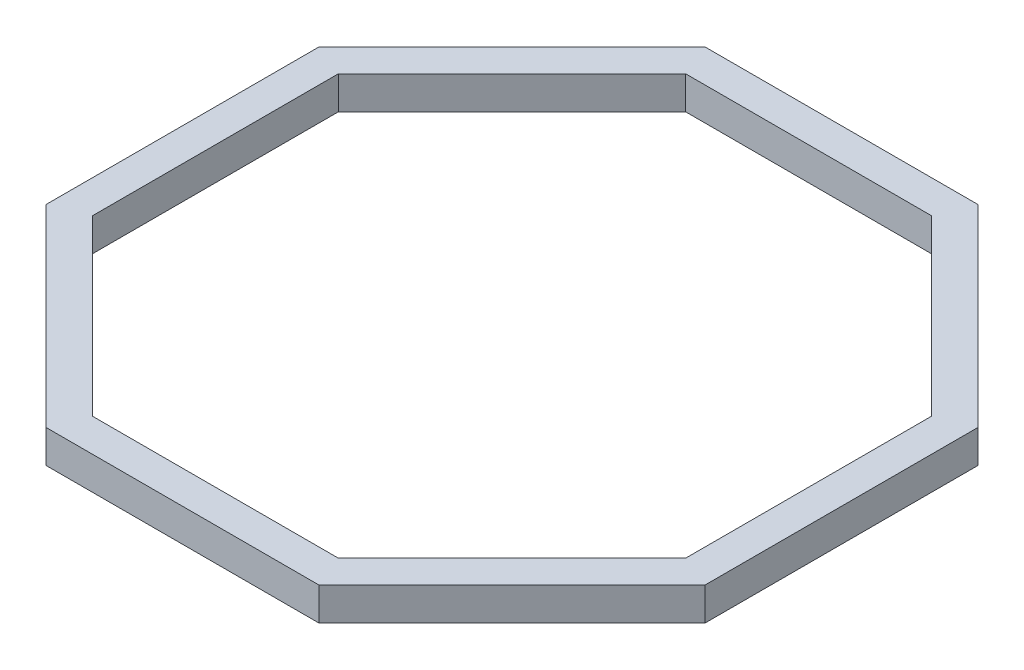
ISO-10303-21;
HEADER;
FILE_DESCRIPTION(('STEP AP214'),'2;1');
FILE_NAME('part.step','',(''),(''),'','','');
FILE_SCHEMA(('AUTOMOTIVE_DESIGN { 1 0 10303 214 1 1 1 1 }'));
ENDSEC;
DATA;
#1=APPLICATION_CONTEXT('core data for automotive mechanical design processes');
#2=APPLICATION_PROTOCOL_DEFINITION('international standard','automotive_design',2000,#1);
#3=PRODUCT_CONTEXT('',#1,'mechanical');
#4=PRODUCT('Part','Part','',(#3));
#5=PRODUCT_RELATED_PRODUCT_CATEGORY('part','',(#4));
#6=PRODUCT_DEFINITION_FORMATION('','',#4);
#7=PRODUCT_DEFINITION_CONTEXT('part definition',#1,'design');
#8=PRODUCT_DEFINITION('design','',#6,#7);
#9=PRODUCT_DEFINITION_SHAPE('','',#8);
#10=(LENGTH_UNIT() NAMED_UNIT(*) SI_UNIT(.MILLI.,.METRE.));
#11=(NAMED_UNIT(*) PLANE_ANGLE_UNIT() SI_UNIT($,.RADIAN.));
#12=(NAMED_UNIT(*) SI_UNIT($,.STERADIAN.) SOLID_ANGLE_UNIT());
#13=UNCERTAINTY_MEASURE_WITH_UNIT(LENGTH_MEASURE(1.E-05),#10,'distance_accuracy_value','');
#14=(GEOMETRIC_REPRESENTATION_CONTEXT(3) GLOBAL_UNCERTAINTY_ASSIGNED_CONTEXT((#13)) GLOBAL_UNIT_ASSIGNED_CONTEXT((#10,
#11,#12)) REPRESENTATION_CONTEXT('',''));
#15=CARTESIAN_POINT('',(0.,0.,0.));
#16=DIRECTION('',(0.,0.,1.));
#17=DIRECTION('',(1.,0.,0.));
#18=AXIS2_PLACEMENT_3D('',#15,#16,#17);
#19=CARTESIAN_POINT('',(0.,30.,0.));
#20=DIRECTION('',(0.,1.,0.));
#21=DIRECTION('',(0.,0.,1.));
#22=AXIS2_PLACEMENT_3D('',#19,#20,#21);
#23=PLANE('',#22);
#24=DIRECTION('',(0.707106781186547,0.,-0.707106781186548));
#25=VECTOR('',#24,1.);
#26=CARTESIAN_POINT('',(124.264068711929,30.,300.));
#27=LINE('',#26,#25);
#28=CARTESIAN_POINT('',(124.264068711929,30.,300.));
#29=VERTEX_POINT('',#28);
#30=CARTESIAN_POINT('',(300.,30.,124.264068711928));
#31=VERTEX_POINT('',#30);
#32=EDGE_CURVE('E242',#29,#31,#27,.T.);
#33=ORIENTED_EDGE('',*,*,#32,.T.);
#34=DIRECTION('',(0.,0.,-1.));
#35=VECTOR('',#34,1.);
#36=CARTESIAN_POINT('',(300.,30.,124.264068711928));
#37=LINE('',#36,#35);
#38=CARTESIAN_POINT('',(300.,30.,-124.264068711929));
#39=VERTEX_POINT('',#38);
#40=EDGE_CURVE('E246',#31,#39,#37,.T.);
#41=ORIENTED_EDGE('',*,*,#40,.T.);
#42=DIRECTION('',(-0.707106781186548,0.,-0.707106781186547));
#43=VECTOR('',#42,1.);
#44=CARTESIAN_POINT('',(300.,30.,-124.264068711929));
#45=LINE('',#44,#43);
#46=CARTESIAN_POINT('',(124.264068711928,30.,-300.));
#47=VERTEX_POINT('',#46);
#48=EDGE_CURVE('E250',#39,#47,#45,.T.);
#49=ORIENTED_EDGE('',*,*,#48,.T.);
#50=DIRECTION('',(-1.,0.,0.));
#51=VECTOR('',#50,1.);
#52=CARTESIAN_POINT('',(124.264068711928,30.,-300.));
#53=LINE('',#52,#51);
#54=CARTESIAN_POINT('',(-124.264068711928,30.,-300.));
#55=VERTEX_POINT('',#54);
#56=EDGE_CURVE('E253',#47,#55,#53,.T.);
#57=ORIENTED_EDGE('',*,*,#56,.T.);
#58=DIRECTION('',(-0.707106781186547,0.,0.707106781186548));
#59=VECTOR('',#58,1.);
#60=CARTESIAN_POINT('',(-124.264068711928,30.,-300.));
#61=LINE('',#60,#59);
#62=CARTESIAN_POINT('',(-300.,30.,-124.264068711928));
#63=VERTEX_POINT('',#62);
#64=EDGE_CURVE('E256',#55,#63,#61,.T.);
#65=ORIENTED_EDGE('',*,*,#64,.T.);
#66=DIRECTION('',(0.,0.,1.));
#67=VECTOR('',#66,1.);
#68=CARTESIAN_POINT('',(-300.,30.,-124.264068711928));
#69=LINE('',#68,#67);
#70=CARTESIAN_POINT('',(-300.,30.,124.264068711929));
#71=VERTEX_POINT('',#70);
#72=EDGE_CURVE('E259',#63,#71,#69,.T.);
#73=ORIENTED_EDGE('',*,*,#72,.T.);
#74=DIRECTION('',(0.707106781186548,0.,0.707106781186547));
#75=VECTOR('',#74,1.);
#76=CARTESIAN_POINT('',(-300.,30.,124.264068711929));
#77=LINE('',#76,#75);
#78=CARTESIAN_POINT('',(-124.264068711928,30.,300.));
#79=VERTEX_POINT('',#78);
#80=EDGE_CURVE('E262',#71,#79,#77,.T.);
#81=ORIENTED_EDGE('',*,*,#80,.T.);
#82=DIRECTION('',(1.,0.,0.));
#83=VECTOR('',#82,1.);
#84=CARTESIAN_POINT('',(-124.264068711928,30.,300.));
#85=LINE('',#84,#83);
#86=EDGE_CURVE('E265',#79,#29,#85,.T.);
#87=ORIENTED_EDGE('',*,*,#86,.T.);
#88=EDGE_LOOP('',(#33,#41,#49,#57,#65,#73,#81,#87));
#89=FACE_BOUND('',#88,.T.);
#90=DIRECTION('',(0.,0.,-1.));
#91=VECTOR('',#90,1.);
#92=CARTESIAN_POINT('',(270.,30.,111.837661840736));
#93=LINE('',#92,#91);
#94=CARTESIAN_POINT('',(270.,30.,111.837661840736));
#95=VERTEX_POINT('',#94);
#96=CARTESIAN_POINT('',(270.,30.,-111.837661840736));
#97=VERTEX_POINT('',#96);
#98=EDGE_CURVE('E162',#95,#97,#93,.T.);
#99=ORIENTED_EDGE('',*,*,#98,.F.);
#100=DIRECTION('',(0.707106781186547,0.,-0.707106781186548));
#101=VECTOR('',#100,1.);
#102=CARTESIAN_POINT('',(111.837661840736,30.,270.));
#103=LINE('',#102,#101);
#104=CARTESIAN_POINT('',(111.837661840736,30.,270.));
#105=VERTEX_POINT('',#104);
#106=EDGE_CURVE('E153',#105,#95,#103,.T.);
#107=ORIENTED_EDGE('',*,*,#106,.F.);
#108=DIRECTION('',(1.,0.,0.));
#109=VECTOR('',#108,1.);
#110=CARTESIAN_POINT('',(-111.837661840736,30.,270.));
#111=LINE('',#110,#109);
#112=CARTESIAN_POINT('',(-111.837661840736,30.,270.));
#113=VERTEX_POINT('',#112);
#114=EDGE_CURVE('E194',#113,#105,#111,.T.);
#115=ORIENTED_EDGE('',*,*,#114,.F.);
#116=DIRECTION('',(0.707106781186548,0.,0.707106781186547));
#117=VECTOR('',#116,1.);
#118=CARTESIAN_POINT('',(-270.,30.,111.837661840736));
#119=LINE('',#118,#117);
#120=CARTESIAN_POINT('',(-270.,30.,111.837661840736));
#121=VERTEX_POINT('',#120);
#122=EDGE_CURVE('E191',#121,#113,#119,.T.);
#123=ORIENTED_EDGE('',*,*,#122,.F.);
#124=DIRECTION('',(0.,0.,1.));
#125=VECTOR('',#124,1.);
#126=CARTESIAN_POINT('',(-270.,30.,-111.837661840736));
#127=LINE('',#126,#125);
#128=CARTESIAN_POINT('',(-270.,30.,-111.837661840736));
#129=VERTEX_POINT('',#128);
#130=EDGE_CURVE('E188',#129,#121,#127,.T.);
#131=ORIENTED_EDGE('',*,*,#130,.F.);
#132=DIRECTION('',(-0.707106781186547,0.,0.707106781186548));
#133=VECTOR('',#132,1.);
#134=CARTESIAN_POINT('',(-111.837661840736,30.,-270.));
#135=LINE('',#134,#133);
#136=CARTESIAN_POINT('',(-111.837661840736,30.,-270.));
#137=VERTEX_POINT('',#136);
#138=EDGE_CURVE('E185',#137,#129,#135,.T.);
#139=ORIENTED_EDGE('',*,*,#138,.F.);
#140=DIRECTION('',(-1.,0.,0.));
#141=VECTOR('',#140,1.);
#142=CARTESIAN_POINT('',(111.837661840736,30.,-270.));
#143=LINE('',#142,#141);
#144=CARTESIAN_POINT('',(111.837661840736,30.,-270.));
#145=VERTEX_POINT('',#144);
#146=EDGE_CURVE('E180',#145,#137,#143,.T.);
#147=ORIENTED_EDGE('',*,*,#146,.F.);
#148=DIRECTION('',(-0.707106781186548,0.,-0.707106781186547));
#149=VECTOR('',#148,1.);
#150=CARTESIAN_POINT('',(270.,30.,-111.837661840736));
#151=LINE('',#150,#149);
#152=EDGE_CURVE('E176',#97,#145,#151,.T.);
#153=ORIENTED_EDGE('',*,*,#152,.F.);
#154=EDGE_LOOP('',(#99,#107,#115,#123,#131,#139,#147,#153));
#155=FACE_BOUND('',#154,.T.);
#156=ADVANCED_FACE('F39',(#89,#155),#23,.T.);
#157=CARTESIAN_POINT('',(0.,0.,0.));
#158=DIRECTION('',(0.,1.,0.));
#159=DIRECTION('',(0.,0.,1.));
#160=AXIS2_PLACEMENT_3D('',#157,#158,#159);
#161=PLANE('',#160);
#162=DIRECTION('',(0.707106781186547,0.,-0.707106781186548));
#163=VECTOR('',#162,1.);
#164=CARTESIAN_POINT('',(124.264068711929,0.,300.));
#165=LINE('',#164,#163);
#166=CARTESIAN_POINT('',(124.264068711929,0.,300.));
#167=VERTEX_POINT('',#166);
#168=CARTESIAN_POINT('',(300.,0.,124.264068711928));
#169=VERTEX_POINT('',#168);
#170=EDGE_CURVE('E171',#167,#169,#165,.T.);
#171=ORIENTED_EDGE('',*,*,#170,.F.);
#172=DIRECTION('',(1.,0.,0.));
#173=VECTOR('',#172,1.);
#174=CARTESIAN_POINT('',(-124.264068711928,0.,300.));
#175=LINE('',#174,#173);
#176=CARTESIAN_POINT('',(-124.264068711928,0.,300.));
#177=VERTEX_POINT('',#176);
#178=EDGE_CURVE('E247',#177,#167,#175,.T.);
#179=ORIENTED_EDGE('',*,*,#178,.F.);
#180=DIRECTION('',(0.707106781186548,0.,0.707106781186547));
#181=VECTOR('',#180,1.);
#182=CARTESIAN_POINT('',(-300.,0.,124.264068711929));
#183=LINE('',#182,#181);
#184=CARTESIAN_POINT('',(-300.,0.,124.264068711929));
#185=VERTEX_POINT('',#184);
#186=EDGE_CURVE('E287',#185,#177,#183,.T.);
#187=ORIENTED_EDGE('',*,*,#186,.F.);
#188=DIRECTION('',(0.,0.,1.));
#189=VECTOR('',#188,1.);
#190=CARTESIAN_POINT('',(-300.,0.,-124.264068711928));
#191=LINE('',#190,#189);
#192=CARTESIAN_POINT('',(-300.,0.,-124.264068711928));
#193=VERTEX_POINT('',#192);
#194=EDGE_CURVE('E284',#193,#185,#191,.T.);
#195=ORIENTED_EDGE('',*,*,#194,.F.);
#196=DIRECTION('',(-0.707106781186547,0.,0.707106781186548));
#197=VECTOR('',#196,1.);
#198=CARTESIAN_POINT('',(-124.264068711928,0.,-300.));
#199=LINE('',#198,#197);
#200=CARTESIAN_POINT('',(-124.264068711928,0.,-300.));
#201=VERTEX_POINT('',#200);
#202=EDGE_CURVE('E281',#201,#193,#199,.T.);
#203=ORIENTED_EDGE('',*,*,#202,.F.);
#204=DIRECTION('',(-1.,0.,0.));
#205=VECTOR('',#204,1.);
#206=CARTESIAN_POINT('',(124.264068711928,0.,-300.));
#207=LINE('',#206,#205);
#208=CARTESIAN_POINT('',(124.264068711928,0.,-300.));
#209=VERTEX_POINT('',#208);
#210=EDGE_CURVE('E278',#209,#201,#207,.T.);
#211=ORIENTED_EDGE('',*,*,#210,.F.);
#212=DIRECTION('',(-0.707106781186548,0.,-0.707106781186547));
#213=VECTOR('',#212,1.);
#214=CARTESIAN_POINT('',(300.,0.,-124.264068711929));
#215=LINE('',#214,#213);
#216=CARTESIAN_POINT('',(300.,0.,-124.264068711929));
#217=VERTEX_POINT('',#216);
#218=EDGE_CURVE('E275',#217,#209,#215,.T.);
#219=ORIENTED_EDGE('',*,*,#218,.F.);
#220=DIRECTION('',(0.,0.,-1.));
#221=VECTOR('',#220,1.);
#222=CARTESIAN_POINT('',(300.,0.,124.264068711928));
#223=LINE('',#222,#221);
#224=EDGE_CURVE('E272',#169,#217,#223,.T.);
#225=ORIENTED_EDGE('',*,*,#224,.F.);
#226=EDGE_LOOP('',(#171,#179,#187,#195,#203,#211,#219,#225));
#227=FACE_BOUND('',#226,.T.);
#228=DIRECTION('',(0.707106781186547,0.,-0.707106781186548));
#229=VECTOR('',#228,1.);
#230=CARTESIAN_POINT('',(111.837661840736,0.,270.));
#231=LINE('',#230,#229);
#232=CARTESIAN_POINT('',(111.837661840736,0.,270.));
#233=VERTEX_POINT('',#232);
#234=CARTESIAN_POINT('',(270.,0.,111.837661840736));
#235=VERTEX_POINT('',#234);
#236=EDGE_CURVE('E63',#233,#235,#231,.T.);
#237=ORIENTED_EDGE('',*,*,#236,.T.);
#238=DIRECTION('',(0.,0.,-1.));
#239=VECTOR('',#238,1.);
#240=CARTESIAN_POINT('',(270.,0.,111.837661840736));
#241=LINE('',#240,#239);
#242=CARTESIAN_POINT('',(270.,0.,-111.837661840736));
#243=VERTEX_POINT('',#242);
#244=EDGE_CURVE('E169',#235,#243,#241,.T.);
#245=ORIENTED_EDGE('',*,*,#244,.T.);
#246=DIRECTION('',(-0.707106781186548,0.,-0.707106781186547));
#247=VECTOR('',#246,1.);
#248=CARTESIAN_POINT('',(270.,0.,-111.837661840736));
#249=LINE('',#248,#247);
#250=CARTESIAN_POINT('',(111.837661840736,0.,-270.));
#251=VERTEX_POINT('',#250);
#252=EDGE_CURVE('E201',#243,#251,#249,.T.);
#253=ORIENTED_EDGE('',*,*,#252,.T.);
#254=DIRECTION('',(-1.,0.,0.));
#255=VECTOR('',#254,1.);
#256=CARTESIAN_POINT('',(111.837661840736,0.,-270.));
#257=LINE('',#256,#255);
#258=CARTESIAN_POINT('',(-111.837661840736,0.,-270.));
#259=VERTEX_POINT('',#258);
#260=EDGE_CURVE('E205',#251,#259,#257,.T.);
#261=ORIENTED_EDGE('',*,*,#260,.T.);
#262=DIRECTION('',(-0.707106781186547,0.,0.707106781186548));
#263=VECTOR('',#262,1.);
#264=CARTESIAN_POINT('',(-111.837661840736,0.,-270.));
#265=LINE('',#264,#263);
#266=CARTESIAN_POINT('',(-270.,0.,-111.837661840736));
#267=VERTEX_POINT('',#266);
#268=EDGE_CURVE('E209',#259,#267,#265,.T.);
#269=ORIENTED_EDGE('',*,*,#268,.T.);
#270=DIRECTION('',(0.,0.,1.));
#271=VECTOR('',#270,1.);
#272=CARTESIAN_POINT('',(-270.,0.,-111.837661840736));
#273=LINE('',#272,#271);
#274=CARTESIAN_POINT('',(-270.,0.,111.837661840736));
#275=VERTEX_POINT('',#274);
#276=EDGE_CURVE('E213',#267,#275,#273,.T.);
#277=ORIENTED_EDGE('',*,*,#276,.T.);
#278=DIRECTION('',(0.707106781186548,0.,0.707106781186547));
#279=VECTOR('',#278,1.);
#280=CARTESIAN_POINT('',(-270.,0.,111.837661840736));
#281=LINE('',#280,#279);
#282=CARTESIAN_POINT('',(-111.837661840736,0.,270.));
#283=VERTEX_POINT('',#282);
#284=EDGE_CURVE('E217',#275,#283,#281,.T.);
#285=ORIENTED_EDGE('',*,*,#284,.T.);
#286=DIRECTION('',(1.,0.,0.));
#287=VECTOR('',#286,1.);
#288=CARTESIAN_POINT('',(-111.837661840736,0.,270.));
#289=LINE('',#288,#287);
#290=EDGE_CURVE('E163',#283,#233,#289,.T.);
#291=ORIENTED_EDGE('',*,*,#290,.T.);
#292=EDGE_LOOP('',(#237,#245,#253,#261,#269,#277,#285,#291));
#293=FACE_BOUND('',#292,.T.);
#294=ADVANCED_FACE('F326',(#227,#293),#161,.F.);
#295=CARTESIAN_POINT('',(124.264068711929,30.,300.));
#296=DIRECTION('',(-0.707106781186548,0.,-0.707106781186547));
#297=DIRECTION('',(-0.707106781186547,0.,0.707106781186548));
#298=AXIS2_PLACEMENT_3D('',#295,#296,#297);
#299=PLANE('',#298);
#300=ORIENTED_EDGE('',*,*,#170,.T.);
#301=DIRECTION('',(0.,-1.,0.));
#302=VECTOR('',#301,1.);
#303=CARTESIAN_POINT('',(300.,30.,124.264068711928));
#304=LINE('',#303,#302);
#305=EDGE_CURVE('E11',#31,#169,#304,.T.);
#306=ORIENTED_EDGE('',*,*,#305,.F.);
#307=ORIENTED_EDGE('',*,*,#32,.F.);
#308=DIRECTION('',(0.,-1.,0.));
#309=VECTOR('',#308,1.);
#310=CARTESIAN_POINT('',(124.264068711929,30.,300.));
#311=LINE('',#310,#309);
#312=EDGE_CURVE('E268',#29,#167,#311,.T.);
#313=ORIENTED_EDGE('',*,*,#312,.T.);
#314=EDGE_LOOP('',(#300,#306,#307,#313));
#315=FACE_BOUND('',#314,.T.);
#316=ADVANCED_FACE('F41',(#315),#299,.F.);
#317=CARTESIAN_POINT('',(300.,30.,124.264068711928));
#318=DIRECTION('',(-1.,0.,0.));
#319=DIRECTION('',(0.,0.,1.));
#320=AXIS2_PLACEMENT_3D('',#317,#318,#319);
#321=PLANE('',#320);
#322=ORIENTED_EDGE('',*,*,#224,.T.);
#323=DIRECTION('',(0.,-1.,0.));
#324=VECTOR('',#323,1.);
#325=CARTESIAN_POINT('',(300.,30.,-124.264068711929));
#326=LINE('',#325,#324);
#327=EDGE_CURVE('E48',#39,#217,#326,.T.);
#328=ORIENTED_EDGE('',*,*,#327,.F.);
#329=ORIENTED_EDGE('',*,*,#40,.F.);
#330=ORIENTED_EDGE('',*,*,#305,.T.);
#331=EDGE_LOOP('',(#322,#328,#329,#330));
#332=FACE_BOUND('',#331,.T.);
#333=ADVANCED_FACE('F343',(#332),#321,.F.);
#334=CARTESIAN_POINT('',(300.,30.,-124.264068711929));
#335=DIRECTION('',(-0.707106781186547,0.,0.707106781186548));
#336=DIRECTION('',(0.707106781186548,0.,0.707106781186547));
#337=AXIS2_PLACEMENT_3D('',#334,#335,#336);
#338=PLANE('',#337);
#339=ORIENTED_EDGE('',*,*,#218,.T.);
#340=DIRECTION('',(0.,-1.,0.));
#341=VECTOR('',#340,1.);
#342=CARTESIAN_POINT('',(124.264068711928,30.,-300.));
#343=LINE('',#342,#341);
#344=EDGE_CURVE('E311',#47,#209,#343,.T.);
#345=ORIENTED_EDGE('',*,*,#344,.F.);
#346=ORIENTED_EDGE('',*,*,#48,.F.);
#347=ORIENTED_EDGE('',*,*,#327,.T.);
#348=EDGE_LOOP('',(#339,#345,#346,#347));
#349=FACE_BOUND('',#348,.T.);
#350=ADVANCED_FACE('F320',(#349),#338,.F.);
#351=CARTESIAN_POINT('',(124.264068711928,30.,-300.));
#352=DIRECTION('',(0.,0.,1.));
#353=DIRECTION('',(1.,0.,0.));
#354=AXIS2_PLACEMENT_3D('',#351,#352,#353);
#355=PLANE('',#354);
#356=ORIENTED_EDGE('',*,*,#210,.T.);
#357=DIRECTION('',(0.,-1.,0.));
#358=VECTOR('',#357,1.);
#359=CARTESIAN_POINT('',(-124.264068711928,30.,-300.));
#360=LINE('',#359,#358);
#361=EDGE_CURVE('E307',#55,#201,#360,.T.);
#362=ORIENTED_EDGE('',*,*,#361,.F.);
#363=ORIENTED_EDGE('',*,*,#56,.F.);
#364=ORIENTED_EDGE('',*,*,#344,.T.);
#365=EDGE_LOOP('',(#356,#362,#363,#364));
#366=FACE_BOUND('',#365,.T.);
#367=ADVANCED_FACE('F332',(#366),#355,.F.);
#368=CARTESIAN_POINT('',(-124.264068711928,30.,-300.));
#369=DIRECTION('',(0.707106781186548,0.,0.707106781186547));
#370=DIRECTION('',(0.707106781186547,0.,-0.707106781186548));
#371=AXIS2_PLACEMENT_3D('',#368,#369,#370);
#372=PLANE('',#371);
#373=ORIENTED_EDGE('',*,*,#202,.T.);
#374=DIRECTION('',(0.,-1.,0.));
#375=VECTOR('',#374,1.);
#376=CARTESIAN_POINT('',(-300.,30.,-124.264068711928));
#377=LINE('',#376,#375);
#378=EDGE_CURVE('E303',#63,#193,#377,.T.);
#379=ORIENTED_EDGE('',*,*,#378,.F.);
#380=ORIENTED_EDGE('',*,*,#64,.F.);
#381=ORIENTED_EDGE('',*,*,#361,.T.);
#382=EDGE_LOOP('',(#373,#379,#380,#381));
#383=FACE_BOUND('',#382,.T.);
#384=ADVANCED_FACE('F336',(#383),#372,.F.);
#385=CARTESIAN_POINT('',(-300.,30.,-124.264068711928));
#386=DIRECTION('',(1.,0.,0.));
#387=DIRECTION('',(0.,0.,-1.));
#388=AXIS2_PLACEMENT_3D('',#385,#386,#387);
#389=PLANE('',#388);
#390=ORIENTED_EDGE('',*,*,#194,.T.);
#391=DIRECTION('',(0.,-1.,0.));
#392=VECTOR('',#391,1.);
#393=CARTESIAN_POINT('',(-300.,30.,124.264068711929));
#394=LINE('',#393,#392);
#395=EDGE_CURVE('E299',#71,#185,#394,.T.);
#396=ORIENTED_EDGE('',*,*,#395,.F.);
#397=ORIENTED_EDGE('',*,*,#72,.F.);
#398=ORIENTED_EDGE('',*,*,#378,.T.);
#399=EDGE_LOOP('',(#390,#396,#397,#398));
#400=FACE_BOUND('',#399,.T.);
#401=ADVANCED_FACE('F356',(#400),#389,.F.);
#402=CARTESIAN_POINT('',(-300.,30.,124.264068711929));
#403=DIRECTION('',(0.707106781186547,0.,-0.707106781186548));
#404=DIRECTION('',(-0.707106781186548,0.,-0.707106781186547));
#405=AXIS2_PLACEMENT_3D('',#402,#403,#404);
#406=PLANE('',#405);
#407=ORIENTED_EDGE('',*,*,#186,.T.);
#408=DIRECTION('',(0.,-1.,0.));
#409=VECTOR('',#408,1.);
#410=CARTESIAN_POINT('',(-124.264068711928,30.,300.));
#411=LINE('',#410,#409);
#412=EDGE_CURVE('E295',#79,#177,#411,.T.);
#413=ORIENTED_EDGE('',*,*,#412,.F.);
#414=ORIENTED_EDGE('',*,*,#80,.F.);
#415=ORIENTED_EDGE('',*,*,#395,.T.);
#416=EDGE_LOOP('',(#407,#413,#414,#415));
#417=FACE_BOUND('',#416,.T.);
#418=ADVANCED_FACE('F354',(#417),#406,.F.);
#419=CARTESIAN_POINT('',(-124.264068711928,30.,300.));
#420=DIRECTION('',(0.,0.,-1.));
#421=DIRECTION('',(-1.,0.,0.));
#422=AXIS2_PLACEMENT_3D('',#419,#420,#421);
#423=PLANE('',#422);
#424=ORIENTED_EDGE('',*,*,#178,.T.);
#425=ORIENTED_EDGE('',*,*,#312,.F.);
#426=ORIENTED_EDGE('',*,*,#86,.F.);
#427=ORIENTED_EDGE('',*,*,#412,.T.);
#428=EDGE_LOOP('',(#424,#425,#426,#427));
#429=FACE_BOUND('',#428,.T.);
#430=ADVANCED_FACE('F349',(#429),#423,.F.);
#431=CARTESIAN_POINT('',(111.837661840736,30.,270.));
#432=DIRECTION('',(-0.707106781186548,0.,-0.707106781186547));
#433=DIRECTION('',(-0.707106781186547,0.,0.707106781186548));
#434=AXIS2_PLACEMENT_3D('',#431,#432,#433);
#435=PLANE('',#434);
#436=ORIENTED_EDGE('',*,*,#236,.F.);
#437=DIRECTION('',(0.,-1.,0.));
#438=VECTOR('',#437,1.);
#439=CARTESIAN_POINT('',(111.837661840736,30.,270.));
#440=LINE('',#439,#438);
#441=EDGE_CURVE('E157',#105,#233,#440,.T.);
#442=ORIENTED_EDGE('',*,*,#441,.F.);
#443=ORIENTED_EDGE('',*,*,#106,.T.);
#444=DIRECTION('',(0.,-1.,0.));
#445=VECTOR('',#444,1.);
#446=CARTESIAN_POINT('',(270.,30.,111.837661840736));
#447=LINE('',#446,#445);
#448=EDGE_CURVE('E156',#95,#235,#447,.T.);
#449=ORIENTED_EDGE('',*,*,#448,.T.);
#450=EDGE_LOOP('',(#436,#442,#443,#449));
#451=FACE_BOUND('',#450,.T.);
#452=ADVANCED_FACE('F155',(#451),#435,.T.);
#453=CARTESIAN_POINT('',(270.,30.,111.837661840736));
#454=DIRECTION('',(-1.,0.,0.));
#455=DIRECTION('',(0.,0.,1.));
#456=AXIS2_PLACEMENT_3D('',#453,#454,#455);
#457=PLANE('',#456);
#458=ORIENTED_EDGE('',*,*,#244,.F.);
#459=ORIENTED_EDGE('',*,*,#448,.F.);
#460=ORIENTED_EDGE('',*,*,#98,.T.);
#461=DIRECTION('',(0.,-1.,0.));
#462=VECTOR('',#461,1.);
#463=CARTESIAN_POINT('',(270.,30.,-111.837661840736));
#464=LINE('',#463,#462);
#465=EDGE_CURVE('E172',#97,#243,#464,.T.);
#466=ORIENTED_EDGE('',*,*,#465,.T.);
#467=EDGE_LOOP('',(#458,#459,#460,#466));
#468=FACE_BOUND('',#467,.T.);
#469=ADVANCED_FACE('F166',(#468),#457,.T.);
#470=CARTESIAN_POINT('',(270.,30.,-111.837661840736));
#471=DIRECTION('',(-0.707106781186547,0.,0.707106781186548));
#472=DIRECTION('',(0.707106781186548,0.,0.707106781186547));
#473=AXIS2_PLACEMENT_3D('',#470,#471,#472);
#474=PLANE('',#473);
#475=ORIENTED_EDGE('',*,*,#252,.F.);
#476=ORIENTED_EDGE('',*,*,#465,.F.);
#477=ORIENTED_EDGE('',*,*,#152,.T.);
#478=DIRECTION('',(0.,-1.,0.));
#479=VECTOR('',#478,1.);
#480=CARTESIAN_POINT('',(111.837661840736,30.,-270.));
#481=LINE('',#480,#479);
#482=EDGE_CURVE('E237',#145,#251,#481,.T.);
#483=ORIENTED_EDGE('',*,*,#482,.T.);
#484=EDGE_LOOP('',(#475,#476,#477,#483));
#485=FACE_BOUND('',#484,.T.);
#486=ADVANCED_FACE('F381',(#485),#474,.T.);
#487=CARTESIAN_POINT('',(111.837661840736,30.,-270.));
#488=DIRECTION('',(0.,0.,1.));
#489=DIRECTION('',(1.,0.,0.));
#490=AXIS2_PLACEMENT_3D('',#487,#488,#489);
#491=PLANE('',#490);
#492=ORIENTED_EDGE('',*,*,#260,.F.);
#493=ORIENTED_EDGE('',*,*,#482,.F.);
#494=ORIENTED_EDGE('',*,*,#146,.T.);
#495=DIRECTION('',(0.,-1.,0.));
#496=VECTOR('',#495,1.);
#497=CARTESIAN_POINT('',(-111.837661840736,30.,-270.));
#498=LINE('',#497,#496);
#499=EDGE_CURVE('E234',#137,#259,#498,.T.);
#500=ORIENTED_EDGE('',*,*,#499,.T.);
#501=EDGE_LOOP('',(#492,#493,#494,#500));
#502=FACE_BOUND('',#501,.T.);
#503=ADVANCED_FACE('F385',(#502),#491,.T.);
#504=CARTESIAN_POINT('',(-111.837661840736,30.,-270.));
#505=DIRECTION('',(0.707106781186548,0.,0.707106781186547));
#506=DIRECTION('',(0.707106781186547,0.,-0.707106781186548));
#507=AXIS2_PLACEMENT_3D('',#504,#505,#506);
#508=PLANE('',#507);
#509=ORIENTED_EDGE('',*,*,#268,.F.);
#510=ORIENTED_EDGE('',*,*,#499,.F.);
#511=ORIENTED_EDGE('',*,*,#138,.T.);
#512=DIRECTION('',(0.,-1.,0.));
#513=VECTOR('',#512,1.);
#514=CARTESIAN_POINT('',(-270.,30.,-111.837661840736));
#515=LINE('',#514,#513);
#516=EDGE_CURVE('E231',#129,#267,#515,.T.);
#517=ORIENTED_EDGE('',*,*,#516,.T.);
#518=EDGE_LOOP('',(#509,#510,#511,#517));
#519=FACE_BOUND('',#518,.T.);
#520=ADVANCED_FACE('F391',(#519),#508,.T.);
#521=CARTESIAN_POINT('',(-270.,30.,-111.837661840736));
#522=DIRECTION('',(1.,0.,0.));
#523=DIRECTION('',(0.,0.,-1.));
#524=AXIS2_PLACEMENT_3D('',#521,#522,#523);
#525=PLANE('',#524);
#526=ORIENTED_EDGE('',*,*,#276,.F.);
#527=ORIENTED_EDGE('',*,*,#516,.F.);
#528=ORIENTED_EDGE('',*,*,#130,.T.);
#529=DIRECTION('',(0.,-1.,0.));
#530=VECTOR('',#529,1.);
#531=CARTESIAN_POINT('',(-270.,30.,111.837661840736));
#532=LINE('',#531,#530);
#533=EDGE_CURVE('E228',#121,#275,#532,.T.);
#534=ORIENTED_EDGE('',*,*,#533,.T.);
#535=EDGE_LOOP('',(#526,#527,#528,#534));
#536=FACE_BOUND('',#535,.T.);
#537=ADVANCED_FACE('F395',(#536),#525,.T.);
#538=CARTESIAN_POINT('',(-270.,30.,111.837661840736));
#539=DIRECTION('',(0.707106781186547,0.,-0.707106781186548));
#540=DIRECTION('',(-0.707106781186548,0.,-0.707106781186547));
#541=AXIS2_PLACEMENT_3D('',#538,#539,#540);
#542=PLANE('',#541);
#543=ORIENTED_EDGE('',*,*,#284,.F.);
#544=ORIENTED_EDGE('',*,*,#533,.F.);
#545=ORIENTED_EDGE('',*,*,#122,.T.);
#546=DIRECTION('',(0.,-1.,0.));
#547=VECTOR('',#546,1.);
#548=CARTESIAN_POINT('',(-111.837661840736,30.,270.));
#549=LINE('',#548,#547);
#550=EDGE_CURVE('E55',#113,#283,#549,.T.);
#551=ORIENTED_EDGE('',*,*,#550,.T.);
#552=EDGE_LOOP('',(#543,#544,#545,#551));
#553=FACE_BOUND('',#552,.T.);
#554=ADVANCED_FACE('F399',(#553),#542,.T.);
#555=CARTESIAN_POINT('',(-111.837661840736,30.,270.));
#556=DIRECTION('',(0.,0.,-1.));
#557=DIRECTION('',(-1.,0.,0.));
#558=AXIS2_PLACEMENT_3D('',#555,#556,#557);
#559=PLANE('',#558);
#560=ORIENTED_EDGE('',*,*,#290,.F.);
#561=ORIENTED_EDGE('',*,*,#550,.F.);
#562=ORIENTED_EDGE('',*,*,#114,.T.);
#563=ORIENTED_EDGE('',*,*,#441,.T.);
#564=EDGE_LOOP('',(#560,#561,#562,#563));
#565=FACE_BOUND('',#564,.T.);
#566=ADVANCED_FACE('F403',(#565),#559,.T.);
#567=CLOSED_SHELL('',(#156,#294,#316,#333,#350,#367,#384,#401,#418,#430,#452,#469,#486,#503,
#520,#537,#554,#566));
#568=MANIFOLD_SOLID_BREP('B2',#567);
#569=ADVANCED_BREP_SHAPE_REPRESENTATION('',(#18,#568),#14);
#570=SHAPE_DEFINITION_REPRESENTATION(#9,#569);
ENDSEC;
END-ISO-10303-21;
